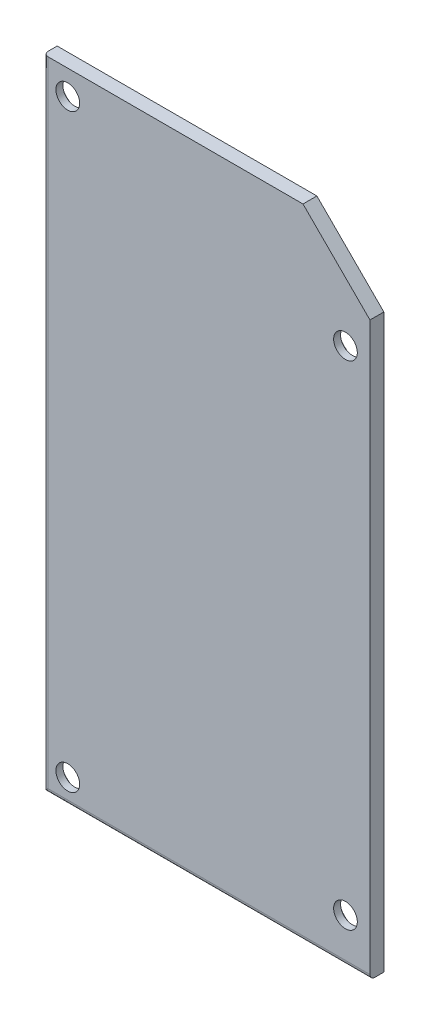
ISO-10303-21;
HEADER;
FILE_DESCRIPTION(('STEP AP214'),'2;1');
FILE_NAME('part.step','',(''),(''),'','','');
FILE_SCHEMA(('AUTOMOTIVE_DESIGN { 1 0 10303 214 1 1 1 1 }'));
ENDSEC;
DATA;
#1=APPLICATION_CONTEXT('core data for automotive mechanical design processes');
#2=APPLICATION_PROTOCOL_DEFINITION('international standard','automotive_design',2000,#1);
#3=PRODUCT_CONTEXT('',#1,'mechanical');
#4=PRODUCT('Part','Part','',(#3));
#5=PRODUCT_RELATED_PRODUCT_CATEGORY('part','',(#4));
#6=PRODUCT_DEFINITION_FORMATION('','',#4);
#7=PRODUCT_DEFINITION_CONTEXT('part definition',#1,'design');
#8=PRODUCT_DEFINITION('design','',#6,#7);
#9=PRODUCT_DEFINITION_SHAPE('','',#8);
#10=(LENGTH_UNIT() NAMED_UNIT(*) SI_UNIT(.MILLI.,.METRE.));
#11=(NAMED_UNIT(*) PLANE_ANGLE_UNIT() SI_UNIT($,.RADIAN.));
#12=(NAMED_UNIT(*) SI_UNIT($,.STERADIAN.) SOLID_ANGLE_UNIT());
#13=UNCERTAINTY_MEASURE_WITH_UNIT(LENGTH_MEASURE(1.E-05),#10,'distance_accuracy_value','');
#14=(GEOMETRIC_REPRESENTATION_CONTEXT(3) GLOBAL_UNCERTAINTY_ASSIGNED_CONTEXT((#13)) GLOBAL_UNIT_ASSIGNED_CONTEXT((#10,
#11,#12)) REPRESENTATION_CONTEXT('',''));
#15=CARTESIAN_POINT('',(0.,0.,0.));
#16=DIRECTION('',(0.,0.,1.));
#17=DIRECTION('',(1.,0.,0.));
#18=AXIS2_PLACEMENT_3D('',#15,#16,#17);
#19=CARTESIAN_POINT('',(0.,0.,28.));
#20=DIRECTION('',(0.,0.,-1.));
#21=DIRECTION('',(-1.,0.,0.));
#22=AXIS2_PLACEMENT_3D('',#19,#20,#21);
#23=PLANE('',#22);
#24=CARTESIAN_POINT('',(3.,3.,28.));
#25=DIRECTION('',(0.,0.,1.));
#26=DIRECTION('',(1.,0.,0.));
#27=AXIS2_PLACEMENT_3D('',#24,#25,#26);
#28=CIRCLE('',#27,2.6);
#29=CARTESIAN_POINT('',(5.6,3.,28.));
#30=VERTEX_POINT('',#29);
#31=EDGE_CURVE('E168',#30,#30,#28,.T.);
#32=ORIENTED_EDGE('',*,*,#31,.T.);
#33=EDGE_LOOP('',(#32));
#34=FACE_BOUND('',#33,.T.);
#35=CARTESIAN_POINT('',(3.,75.2,28.));
#36=DIRECTION('',(0.,0.,1.));
#37=DIRECTION('',(1.,0.,0.));
#38=AXIS2_PLACEMENT_3D('',#35,#36,#37);
#39=CIRCLE('',#38,2.6);
#40=CARTESIAN_POINT('',(5.6,75.2,28.));
#41=VERTEX_POINT('',#40);
#42=EDGE_CURVE('E123',#41,#41,#39,.T.);
#43=ORIENTED_EDGE('',*,*,#42,.T.);
#44=EDGE_LOOP('',(#43));
#45=FACE_BOUND('',#44,.T.);
#46=DIRECTION('',(-1.,0.,0.));
#47=VECTOR('',#46,1.);
#48=CARTESIAN_POINT('',(0.,0.,28.));
#49=LINE('',#48,#47);
#50=CARTESIAN_POINT('',(40.,0.,28.));
#51=VERTEX_POINT('',#50);
#52=CARTESIAN_POINT('',(0.,0.,28.));
#53=VERTEX_POINT('',#52);
#54=EDGE_CURVE('E107',#51,#53,#49,.T.);
#55=ORIENTED_EDGE('',*,*,#54,.T.);
#56=DIRECTION('',(0.,-1.,0.));
#57=VECTOR('',#56,1.);
#58=CARTESIAN_POINT('',(0.,0.,28.));
#59=LINE('',#58,#57);
#60=CARTESIAN_POINT('',(0.,78.2,28.));
#61=VERTEX_POINT('',#60);
#62=EDGE_CURVE('E93',#61,#53,#59,.T.);
#63=ORIENTED_EDGE('',*,*,#62,.F.);
#64=DIRECTION('',(1.,0.,0.));
#65=VECTOR('',#64,1.);
#66=CARTESIAN_POINT('',(0.,78.2,28.));
#67=LINE('',#66,#65);
#68=CARTESIAN_POINT('',(31.8000000000001,78.2,28.));
#69=VERTEX_POINT('',#68);
#70=EDGE_CURVE('E103',#61,#69,#67,.T.);
#71=ORIENTED_EDGE('',*,*,#70,.T.);
#72=DIRECTION('',(0.707106781186544,-0.707106781186551,0.));
#73=VECTOR('',#72,1.);
#74=CARTESIAN_POINT('',(31.8000000000001,78.2,28.));
#75=LINE('',#74,#73);
#76=CARTESIAN_POINT('',(40.,70.,28.));
#77=VERTEX_POINT('',#76);
#78=EDGE_CURVE('E114',#69,#77,#75,.T.);
#79=ORIENTED_EDGE('',*,*,#78,.T.);
#80=DIRECTION('',(0.,-1.,0.));
#81=VECTOR('',#80,1.);
#82=CARTESIAN_POINT('',(40.,0.,28.));
#83=LINE('',#82,#81);
#84=EDGE_CURVE('E117',#77,#51,#83,.T.);
#85=ORIENTED_EDGE('',*,*,#84,.T.);
#86=EDGE_LOOP('',(#55,#63,#71,#79,#85));
#87=FACE_BOUND('',#86,.T.);
#88=CARTESIAN_POINT('',(37.,65.7573593128807,28.));
#89=DIRECTION('',(0.,0.,1.));
#90=DIRECTION('',(1.,0.,0.));
#91=AXIS2_PLACEMENT_3D('',#88,#89,#90);
#92=CIRCLE('',#91,2.6);
#93=CARTESIAN_POINT('',(39.6,65.7573593128807,28.));
#94=VERTEX_POINT('',#93);
#95=EDGE_CURVE('E163',#94,#94,#92,.T.);
#96=ORIENTED_EDGE('',*,*,#95,.T.);
#97=EDGE_LOOP('',(#96));
#98=FACE_BOUND('',#97,.T.);
#99=CARTESIAN_POINT('',(37.,5.39999999999994,28.));
#100=DIRECTION('',(0.,0.,1.));
#101=DIRECTION('',(1.,0.,0.));
#102=AXIS2_PLACEMENT_3D('',#99,#100,#101);
#103=CIRCLE('',#102,2.6);
#104=CARTESIAN_POINT('',(39.6,5.39999999999994,28.));
#105=VERTEX_POINT('',#104);
#106=EDGE_CURVE('E190',#105,#105,#103,.T.);
#107=ORIENTED_EDGE('',*,*,#106,.T.);
#108=EDGE_LOOP('',(#107));
#109=FACE_BOUND('',#108,.T.);
#110=ADVANCED_FACE('F36',(#34,#45,#87,#98,#109),#23,.T.);
#111=CARTESIAN_POINT('',(0.,0.,28.));
#112=DIRECTION('',(0.,1.,0.));
#113=DIRECTION('',(0.,0.,1.));
#114=AXIS2_PLACEMENT_3D('',#111,#112,#113);
#115=PLANE('',#114);
#116=DIRECTION('',(0.,0.,-1.));
#117=VECTOR('',#116,1.);
#118=CARTESIAN_POINT('',(40.,0.,28.));
#119=LINE('',#118,#117);
#120=CARTESIAN_POINT('',(40.,0.,29.1));
#121=VERTEX_POINT('',#120);
#122=EDGE_CURVE('E151',#121,#51,#119,.T.);
#123=ORIENTED_EDGE('',*,*,#122,.F.);
#124=DIRECTION('',(1.,0.,0.));
#125=VECTOR('',#124,1.);
#126=CARTESIAN_POINT('',(0.,0.,29.1));
#127=LINE('',#126,#125);
#128=CARTESIAN_POINT('',(0.,0.,29.1));
#129=VERTEX_POINT('',#128);
#130=EDGE_CURVE('E59',#121,#129,#127,.F.);
#131=ORIENTED_EDGE('',*,*,#130,.T.);
#132=DIRECTION('',(0.,0.,-1.));
#133=VECTOR('',#132,1.);
#134=CARTESIAN_POINT('',(0.,0.,28.));
#135=LINE('',#134,#133);
#136=EDGE_CURVE('E153',#129,#53,#135,.T.);
#137=ORIENTED_EDGE('',*,*,#136,.T.);
#138=ORIENTED_EDGE('',*,*,#54,.F.);
#139=EDGE_LOOP('',(#123,#131,#137,#138));
#140=FACE_BOUND('',#139,.T.);
#141=ADVANCED_FACE('F184',(#140),#115,.F.);
#142=CARTESIAN_POINT('',(40.,0.,28.));
#143=DIRECTION('',(-1.,0.,0.));
#144=DIRECTION('',(0.,0.,1.));
#145=AXIS2_PLACEMENT_3D('',#142,#143,#144);
#146=PLANE('',#145);
#147=DIRECTION('',(0.,1.,0.));
#148=VECTOR('',#147,1.);
#149=CARTESIAN_POINT('',(40.,70.,29.7));
#150=LINE('',#149,#148);
#151=CARTESIAN_POINT('',(40.,0.600000000000003,29.7));
#152=VERTEX_POINT('',#151);
#153=CARTESIAN_POINT('',(40.,70.,29.7));
#154=VERTEX_POINT('',#153);
#155=EDGE_CURVE('E108',#152,#154,#150,.T.);
#156=ORIENTED_EDGE('',*,*,#155,.F.);
#157=CARTESIAN_POINT('',(40.,0.6,29.1));
#158=DIRECTION('',(-1.,0.,0.));
#159=DIRECTION('',(0.,0.,1.));
#160=AXIS2_PLACEMENT_3D('',#157,#158,#159);
#161=CIRCLE('',#160,0.6);
#162=EDGE_CURVE('E174',#152,#121,#161,.F.);
#163=ORIENTED_EDGE('',*,*,#162,.T.);
#164=ORIENTED_EDGE('',*,*,#122,.T.);
#165=ORIENTED_EDGE('',*,*,#84,.F.);
#166=DIRECTION('',(0.,0.,-1.));
#167=VECTOR('',#166,1.);
#168=CARTESIAN_POINT('',(40.,70.,28.));
#169=LINE('',#168,#167);
#170=EDGE_CURVE('E148',#154,#77,#169,.T.);
#171=ORIENTED_EDGE('',*,*,#170,.F.);
#172=EDGE_LOOP('',(#156,#163,#164,#165,#171));
#173=FACE_BOUND('',#172,.T.);
#174=ADVANCED_FACE('F179',(#173),#146,.F.);
#175=CARTESIAN_POINT('',(31.8000000000001,78.2,28.));
#176=DIRECTION('',(-0.707106781186551,-0.707106781186544,0.));
#177=DIRECTION('',(0.707106781186544,-0.707106781186551,0.));
#178=AXIS2_PLACEMENT_3D('',#175,#176,#177);
#179=PLANE('',#178);
#180=ORIENTED_EDGE('',*,*,#78,.F.);
#181=DIRECTION('',(0.,0.,-1.));
#182=VECTOR('',#181,1.);
#183=CARTESIAN_POINT('',(31.8000000000001,78.2,28.));
#184=LINE('',#183,#182);
#185=CARTESIAN_POINT('',(31.8000000000001,78.2,29.7));
#186=VERTEX_POINT('',#185);
#187=EDGE_CURVE('E98',#186,#69,#184,.T.);
#188=ORIENTED_EDGE('',*,*,#187,.F.);
#189=DIRECTION('',(-0.707106781186544,0.707106781186551,0.));
#190=VECTOR('',#189,1.);
#191=CARTESIAN_POINT('',(31.8000000000001,78.2,29.7));
#192=LINE('',#191,#190);
#193=EDGE_CURVE('E140',#154,#186,#192,.T.);
#194=ORIENTED_EDGE('',*,*,#193,.F.);
#195=ORIENTED_EDGE('',*,*,#170,.T.);
#196=EDGE_LOOP('',(#180,#188,#194,#195));
#197=FACE_BOUND('',#196,.T.);
#198=ADVANCED_FACE('F242',(#197),#179,.F.);
#199=CARTESIAN_POINT('',(0.,78.2,28.));
#200=DIRECTION('',(0.,-1.,0.));
#201=DIRECTION('',(0.,0.,-1.));
#202=AXIS2_PLACEMENT_3D('',#199,#200,#201);
#203=PLANE('',#202);
#204=DIRECTION('',(0.,0.,-1.));
#205=VECTOR('',#204,1.);
#206=CARTESIAN_POINT('',(0.,78.2,28.));
#207=LINE('',#206,#205);
#208=CARTESIAN_POINT('',(0.,78.2,29.1));
#209=VERTEX_POINT('',#208);
#210=EDGE_CURVE('E90',#209,#61,#207,.T.);
#211=ORIENTED_EDGE('',*,*,#210,.F.);
#212=CARTESIAN_POINT('',(0.6,78.2,29.1));
#213=DIRECTION('',(0.,-1.,0.));
#214=DIRECTION('',(0.,0.,-1.));
#215=AXIS2_PLACEMENT_3D('',#212,#213,#214);
#216=CIRCLE('',#215,0.6);
#217=CARTESIAN_POINT('',(0.6,78.2,29.7));
#218=VERTEX_POINT('',#217);
#219=EDGE_CURVE('E11',#209,#218,#216,.F.);
#220=ORIENTED_EDGE('',*,*,#219,.T.);
#221=DIRECTION('',(-1.,0.,0.));
#222=VECTOR('',#221,1.);
#223=CARTESIAN_POINT('',(0.,78.2,29.7));
#224=LINE('',#223,#222);
#225=EDGE_CURVE('E99',#186,#218,#224,.T.);
#226=ORIENTED_EDGE('',*,*,#225,.F.);
#227=ORIENTED_EDGE('',*,*,#187,.T.);
#228=ORIENTED_EDGE('',*,*,#70,.F.);
#229=EDGE_LOOP('',(#211,#220,#226,#227,#228));
#230=FACE_BOUND('',#229,.T.);
#231=ADVANCED_FACE('F112',(#230),#203,.F.);
#232=CARTESIAN_POINT('',(0.,78.2,28.));
#233=DIRECTION('',(1.,0.,0.));
#234=DIRECTION('',(0.,0.,-1.));
#235=AXIS2_PLACEMENT_3D('',#232,#233,#234);
#236=PLANE('',#235);
#237=ORIENTED_EDGE('',*,*,#136,.F.);
#238=DIRECTION('',(0.,-1.,0.));
#239=VECTOR('',#238,1.);
#240=CARTESIAN_POINT('',(0.,78.2,29.1));
#241=LINE('',#240,#239);
#242=EDGE_CURVE('E45',#129,#209,#241,.F.);
#243=ORIENTED_EDGE('',*,*,#242,.T.);
#244=ORIENTED_EDGE('',*,*,#210,.T.);
#245=ORIENTED_EDGE('',*,*,#62,.T.);
#246=EDGE_LOOP('',(#237,#243,#244,#245));
#247=FACE_BOUND('',#246,.T.);
#248=ADVANCED_FACE('F92',(#247),#236,.F.);
#249=CARTESIAN_POINT('',(0.,0.,29.7));
#250=DIRECTION('',(0.,0.,-1.));
#251=DIRECTION('',(-1.,0.,0.));
#252=AXIS2_PLACEMENT_3D('',#249,#250,#251);
#253=PLANE('',#252);
#254=CARTESIAN_POINT('',(37.,5.39999999999994,29.7));
#255=DIRECTION('',(0.,0.,1.));
#256=DIRECTION('',(1.,0.,0.));
#257=AXIS2_PLACEMENT_3D('',#254,#255,#256);
#258=CIRCLE('',#257,1.45);
#259=CARTESIAN_POINT('',(38.45,5.39999999999994,29.7));
#260=VERTEX_POINT('',#259);
#261=EDGE_CURVE('E131',#260,#260,#258,.T.);
#262=ORIENTED_EDGE('',*,*,#261,.F.);
#263=EDGE_LOOP('',(#262));
#264=FACE_BOUND('',#263,.T.);
#265=CARTESIAN_POINT('',(3.,75.2,29.7));
#266=DIRECTION('',(0.,0.,1.));
#267=DIRECTION('',(1.,0.,0.));
#268=AXIS2_PLACEMENT_3D('',#265,#266,#267);
#269=CIRCLE('',#268,1.45);
#270=CARTESIAN_POINT('',(4.45,75.2,29.7));
#271=VERTEX_POINT('',#270);
#272=EDGE_CURVE('E109',#271,#271,#269,.T.);
#273=ORIENTED_EDGE('',*,*,#272,.F.);
#274=EDGE_LOOP('',(#273));
#275=FACE_BOUND('',#274,.T.);
#276=DIRECTION('',(0.,-1.,0.));
#277=VECTOR('',#276,1.);
#278=CARTESIAN_POINT('',(0.6,0.,29.7));
#279=LINE('',#278,#277);
#280=CARTESIAN_POINT('',(0.6,0.6,29.7));
#281=VERTEX_POINT('',#280);
#282=EDGE_CURVE('E154',#218,#281,#279,.T.);
#283=ORIENTED_EDGE('',*,*,#282,.T.);
#284=DIRECTION('',(1.,0.,0.));
#285=VECTOR('',#284,1.);
#286=CARTESIAN_POINT('',(0.,0.6,29.7));
#287=LINE('',#286,#285);
#288=EDGE_CURVE('E171',#281,#152,#287,.T.);
#289=ORIENTED_EDGE('',*,*,#288,.T.);
#290=ORIENTED_EDGE('',*,*,#155,.T.);
#291=ORIENTED_EDGE('',*,*,#193,.T.);
#292=ORIENTED_EDGE('',*,*,#225,.T.);
#293=EDGE_LOOP('',(#283,#289,#290,#291,#292));
#294=FACE_BOUND('',#293,.T.);
#295=CARTESIAN_POINT('',(37.,65.7573593128807,29.7));
#296=DIRECTION('',(0.,0.,1.));
#297=DIRECTION('',(1.,0.,0.));
#298=AXIS2_PLACEMENT_3D('',#295,#296,#297);
#299=CIRCLE('',#298,1.45);
#300=CARTESIAN_POINT('',(38.45,65.7573593128807,29.7));
#301=VERTEX_POINT('',#300);
#302=EDGE_CURVE('E134',#301,#301,#299,.T.);
#303=ORIENTED_EDGE('',*,*,#302,.F.);
#304=EDGE_LOOP('',(#303));
#305=FACE_BOUND('',#304,.T.);
#306=CARTESIAN_POINT('',(3.,3.,29.7));
#307=DIRECTION('',(0.,0.,1.));
#308=DIRECTION('',(1.,0.,0.));
#309=AXIS2_PLACEMENT_3D('',#306,#307,#308);
#310=CIRCLE('',#309,1.45);
#311=CARTESIAN_POINT('',(4.45,3.,29.7));
#312=VERTEX_POINT('',#311);
#313=EDGE_CURVE('E128',#312,#312,#310,.T.);
#314=ORIENTED_EDGE('',*,*,#313,.F.);
#315=EDGE_LOOP('',(#314));
#316=FACE_BOUND('',#315,.T.);
#317=ADVANCED_FACE('F236',(#264,#275,#294,#305,#316),#253,.F.);
#318=CARTESIAN_POINT('',(3.,75.2,29.7));
#319=DIRECTION('',(0.,0.,-1.));
#320=DIRECTION('',(-1.,0.,0.));
#321=AXIS2_PLACEMENT_3D('',#318,#319,#320);
#322=CYLINDRICAL_SURFACE('',#321,1.45);
#323=CARTESIAN_POINT('',(3.,75.2,28.85));
#324=DIRECTION('',(0.,0.,1.));
#325=DIRECTION('',(1.,0.,0.));
#326=AXIS2_PLACEMENT_3D('',#323,#324,#325);
#327=CIRCLE('',#326,1.45);
#328=CARTESIAN_POINT('',(4.45,75.2,28.85));
#329=VERTEX_POINT('',#328);
#330=EDGE_CURVE('E115',#329,#329,#327,.T.);
#331=ORIENTED_EDGE('',*,*,#330,.F.);
#332=EDGE_LOOP('',(#331));
#333=FACE_BOUND('',#332,.T.);
#334=ORIENTED_EDGE('',*,*,#272,.T.);
#335=EDGE_LOOP('',(#334));
#336=FACE_BOUND('',#335,.T.);
#337=ADVANCED_FACE('F262',(#333,#336),#322,.F.);
#338=CARTESIAN_POINT('',(37.,65.7573593128807,29.7));
#339=DIRECTION('',(0.,0.,-1.));
#340=DIRECTION('',(-1.,0.,0.));
#341=AXIS2_PLACEMENT_3D('',#338,#339,#340);
#342=CYLINDRICAL_SURFACE('',#341,1.45);
#343=CARTESIAN_POINT('',(37.,65.7573593128807,28.85));
#344=DIRECTION('',(0.,0.,1.));
#345=DIRECTION('',(1.,0.,0.));
#346=AXIS2_PLACEMENT_3D('',#343,#344,#345);
#347=CIRCLE('',#346,1.45);
#348=CARTESIAN_POINT('',(38.45,65.7573593128807,28.85));
#349=VERTEX_POINT('',#348);
#350=EDGE_CURVE('E156',#349,#349,#347,.T.);
#351=ORIENTED_EDGE('',*,*,#350,.F.);
#352=EDGE_LOOP('',(#351));
#353=FACE_BOUND('',#352,.T.);
#354=ORIENTED_EDGE('',*,*,#302,.T.);
#355=EDGE_LOOP('',(#354));
#356=FACE_BOUND('',#355,.T.);
#357=ADVANCED_FACE('F269',(#353,#356),#342,.F.);
#358=CARTESIAN_POINT('',(37.,5.39999999999994,29.7));
#359=DIRECTION('',(0.,0.,-1.));
#360=DIRECTION('',(-1.,0.,0.));
#361=AXIS2_PLACEMENT_3D('',#358,#359,#360);
#362=CYLINDRICAL_SURFACE('',#361,1.45);
#363=CARTESIAN_POINT('',(37.,5.39999999999994,28.85));
#364=DIRECTION('',(0.,0.,1.));
#365=DIRECTION('',(1.,0.,0.));
#366=AXIS2_PLACEMENT_3D('',#363,#364,#365);
#367=CIRCLE('',#366,1.45);
#368=CARTESIAN_POINT('',(38.45,5.39999999999994,28.85));
#369=VERTEX_POINT('',#368);
#370=EDGE_CURVE('E165',#369,#369,#367,.T.);
#371=ORIENTED_EDGE('',*,*,#370,.F.);
#372=EDGE_LOOP('',(#371));
#373=FACE_BOUND('',#372,.T.);
#374=ORIENTED_EDGE('',*,*,#261,.T.);
#375=EDGE_LOOP('',(#374));
#376=FACE_BOUND('',#375,.T.);
#377=ADVANCED_FACE('F224',(#373,#376),#362,.F.);
#378=CARTESIAN_POINT('',(3.,3.,29.7));
#379=DIRECTION('',(0.,0.,-1.));
#380=DIRECTION('',(-1.,0.,0.));
#381=AXIS2_PLACEMENT_3D('',#378,#379,#380);
#382=CYLINDRICAL_SURFACE('',#381,1.45);
#383=CARTESIAN_POINT('',(3.,3.,28.85));
#384=DIRECTION('',(0.,0.,1.));
#385=DIRECTION('',(1.,0.,0.));
#386=AXIS2_PLACEMENT_3D('',#383,#384,#385);
#387=CIRCLE('',#386,1.45);
#388=CARTESIAN_POINT('',(4.45,3.,28.85));
#389=VERTEX_POINT('',#388);
#390=EDGE_CURVE('E160',#389,#389,#387,.T.);
#391=ORIENTED_EDGE('',*,*,#390,.F.);
#392=EDGE_LOOP('',(#391));
#393=FACE_BOUND('',#392,.T.);
#394=ORIENTED_EDGE('',*,*,#313,.T.);
#395=EDGE_LOOP('',(#394));
#396=FACE_BOUND('',#395,.T.);
#397=ADVANCED_FACE('F215',(#393,#396),#382,.F.);
#398=CARTESIAN_POINT('',(3.,75.2,28.85));
#399=DIRECTION('',(0.,0.,-1.));
#400=DIRECTION('',(-1.,0.,0.));
#401=AXIS2_PLACEMENT_3D('',#398,#399,#400);
#402=CYLINDRICAL_SURFACE('',#401,2.6);
#403=CARTESIAN_POINT('',(3.,75.2,28.85));
#404=DIRECTION('',(0.,0.,1.));
#405=DIRECTION('',(1.,0.,0.));
#406=AXIS2_PLACEMENT_3D('',#403,#404,#405);
#407=CIRCLE('',#406,2.6);
#408=CARTESIAN_POINT('',(5.6,75.2,28.85));
#409=VERTEX_POINT('',#408);
#410=EDGE_CURVE('E120',#409,#409,#407,.T.);
#411=ORIENTED_EDGE('',*,*,#410,.T.);
#412=EDGE_LOOP('',(#411));
#413=FACE_BOUND('',#412,.T.);
#414=ORIENTED_EDGE('',*,*,#42,.F.);
#415=EDGE_LOOP('',(#414));
#416=FACE_BOUND('',#415,.T.);
#417=ADVANCED_FACE('F212',(#413,#416),#402,.F.);
#418=CARTESIAN_POINT('',(3.,75.2,28.85));
#419=DIRECTION('',(0.,0.,1.));
#420=DIRECTION('',(1.,0.,0.));
#421=AXIS2_PLACEMENT_3D('',#418,#419,#420);
#422=PLANE('',#421);
#423=ORIENTED_EDGE('',*,*,#330,.T.);
#424=EDGE_LOOP('',(#423));
#425=FACE_BOUND('',#424,.T.);
#426=ORIENTED_EDGE('',*,*,#410,.F.);
#427=EDGE_LOOP('',(#426));
#428=FACE_BOUND('',#427,.T.);
#429=ADVANCED_FACE('F214',(#425,#428),#422,.F.);
#430=CARTESIAN_POINT('',(37.,65.7573593128807,28.85));
#431=DIRECTION('',(0.,0.,-1.));
#432=DIRECTION('',(-1.,0.,0.));
#433=AXIS2_PLACEMENT_3D('',#430,#431,#432);
#434=CYLINDRICAL_SURFACE('',#433,2.6);
#435=CARTESIAN_POINT('',(37.,65.7573593128807,28.85));
#436=DIRECTION('',(0.,0.,1.));
#437=DIRECTION('',(1.,0.,0.));
#438=AXIS2_PLACEMENT_3D('',#435,#436,#437);
#439=CIRCLE('',#438,2.6);
#440=CARTESIAN_POINT('',(39.6,65.7573593128807,28.85));
#441=VERTEX_POINT('',#440);
#442=EDGE_CURVE('E159',#441,#441,#439,.T.);
#443=ORIENTED_EDGE('',*,*,#442,.T.);
#444=EDGE_LOOP('',(#443));
#445=FACE_BOUND('',#444,.T.);
#446=ORIENTED_EDGE('',*,*,#95,.F.);
#447=EDGE_LOOP('',(#446));
#448=FACE_BOUND('',#447,.T.);
#449=ADVANCED_FACE('F221',(#445,#448),#434,.F.);
#450=CARTESIAN_POINT('',(37.,65.7573593128807,28.85));
#451=DIRECTION('',(0.,0.,1.));
#452=DIRECTION('',(1.,0.,0.));
#453=AXIS2_PLACEMENT_3D('',#450,#451,#452);
#454=PLANE('',#453);
#455=ORIENTED_EDGE('',*,*,#350,.T.);
#456=EDGE_LOOP('',(#455));
#457=FACE_BOUND('',#456,.T.);
#458=ORIENTED_EDGE('',*,*,#442,.F.);
#459=EDGE_LOOP('',(#458));
#460=FACE_BOUND('',#459,.T.);
#461=ADVANCED_FACE('F282',(#457,#460),#454,.F.);
#462=CARTESIAN_POINT('',(3.,3.,28.85));
#463=DIRECTION('',(0.,0.,-1.));
#464=DIRECTION('',(-1.,0.,0.));
#465=AXIS2_PLACEMENT_3D('',#462,#463,#464);
#466=CYLINDRICAL_SURFACE('',#465,2.6);
#467=CARTESIAN_POINT('',(3.,3.,28.85));
#468=DIRECTION('',(0.,0.,1.));
#469=DIRECTION('',(1.,0.,0.));
#470=AXIS2_PLACEMENT_3D('',#467,#468,#469);
#471=CIRCLE('',#470,2.6);
#472=CARTESIAN_POINT('',(5.6,3.,28.85));
#473=VERTEX_POINT('',#472);
#474=EDGE_CURVE('E164',#473,#473,#471,.T.);
#475=ORIENTED_EDGE('',*,*,#474,.T.);
#476=EDGE_LOOP('',(#475));
#477=FACE_BOUND('',#476,.T.);
#478=ORIENTED_EDGE('',*,*,#31,.F.);
#479=EDGE_LOOP('',(#478));
#480=FACE_BOUND('',#479,.T.);
#481=ADVANCED_FACE('F285',(#477,#480),#466,.F.);
#482=CARTESIAN_POINT('',(3.,3.,28.85));
#483=DIRECTION('',(0.,0.,1.));
#484=DIRECTION('',(1.,0.,0.));
#485=AXIS2_PLACEMENT_3D('',#482,#483,#484);
#486=PLANE('',#485);
#487=ORIENTED_EDGE('',*,*,#390,.T.);
#488=EDGE_LOOP('',(#487));
#489=FACE_BOUND('',#488,.T.);
#490=ORIENTED_EDGE('',*,*,#474,.F.);
#491=EDGE_LOOP('',(#490));
#492=FACE_BOUND('',#491,.T.);
#493=ADVANCED_FACE('F298',(#489,#492),#486,.F.);
#494=CARTESIAN_POINT('',(37.,5.39999999999994,28.85));
#495=DIRECTION('',(0.,0.,-1.));
#496=DIRECTION('',(-1.,0.,0.));
#497=AXIS2_PLACEMENT_3D('',#494,#495,#496);
#498=CYLINDRICAL_SURFACE('',#497,2.6);
#499=CARTESIAN_POINT('',(37.,5.39999999999994,28.85));
#500=DIRECTION('',(0.,0.,1.));
#501=DIRECTION('',(1.,0.,0.));
#502=AXIS2_PLACEMENT_3D('',#499,#500,#501);
#503=CIRCLE('',#502,2.6);
#504=CARTESIAN_POINT('',(39.6,5.39999999999994,28.85));
#505=VERTEX_POINT('',#504);
#506=EDGE_CURVE('E169',#505,#505,#503,.T.);
#507=ORIENTED_EDGE('',*,*,#506,.T.);
#508=EDGE_LOOP('',(#507));
#509=FACE_BOUND('',#508,.T.);
#510=ORIENTED_EDGE('',*,*,#106,.F.);
#511=EDGE_LOOP('',(#510));
#512=FACE_BOUND('',#511,.T.);
#513=ADVANCED_FACE('F255',(#509,#512),#498,.F.);
#514=CARTESIAN_POINT('',(37.,5.39999999999994,28.85));
#515=DIRECTION('',(0.,0.,1.));
#516=DIRECTION('',(1.,0.,0.));
#517=AXIS2_PLACEMENT_3D('',#514,#515,#516);
#518=PLANE('',#517);
#519=ORIENTED_EDGE('',*,*,#370,.T.);
#520=EDGE_LOOP('',(#519));
#521=FACE_BOUND('',#520,.T.);
#522=ORIENTED_EDGE('',*,*,#506,.F.);
#523=EDGE_LOOP('',(#522));
#524=FACE_BOUND('',#523,.T.);
#525=ADVANCED_FACE('F251',(#521,#524),#518,.F.);
#526=CARTESIAN_POINT('',(0.6,0.,29.1));
#527=DIRECTION('',(0.,-1.,0.));
#528=DIRECTION('',(0.,0.,-1.));
#529=AXIS2_PLACEMENT_3D('',#526,#527,#528);
#530=CYLINDRICAL_SURFACE('',#529,0.6);
#531=ORIENTED_EDGE('',*,*,#219,.F.);
#532=ORIENTED_EDGE('',*,*,#242,.F.);
#533=CARTESIAN_POINT('',(0.6,0.6,29.1));
#534=DIRECTION('',(0.707106781186547,-0.707106781186547,0.));
#535=DIRECTION('',(-0.707106781186547,-0.707106781186547,0.));
#536=AXIS2_PLACEMENT_3D('',#533,#534,#535);
#537=ELLIPSE('',#536,0.848528137423857,0.6);
#538=EDGE_CURVE('E40',#281,#129,#537,.T.);
#539=ORIENTED_EDGE('',*,*,#538,.F.);
#540=ORIENTED_EDGE('',*,*,#282,.F.);
#541=EDGE_LOOP('',(#531,#532,#539,#540));
#542=FACE_BOUND('',#541,.T.);
#543=ADVANCED_FACE('F38',(#542),#530,.T.);
#544=CARTESIAN_POINT('',(0.,0.6,29.1));
#545=DIRECTION('',(1.,0.,0.));
#546=DIRECTION('',(0.,0.,-1.));
#547=AXIS2_PLACEMENT_3D('',#544,#545,#546);
#548=CYLINDRICAL_SURFACE('',#547,0.6);
#549=ORIENTED_EDGE('',*,*,#538,.T.);
#550=ORIENTED_EDGE('',*,*,#130,.F.);
#551=ORIENTED_EDGE('',*,*,#162,.F.);
#552=ORIENTED_EDGE('',*,*,#288,.F.);
#553=EDGE_LOOP('',(#549,#550,#551,#552));
#554=FACE_BOUND('',#553,.T.);
#555=ADVANCED_FACE('F186',(#554),#548,.T.);
#556=CLOSED_SHELL('',(#110,#141,#174,#198,#231,#248,#317,#337,#357,#377,#397,#417,#429,#449,
#461,#481,#493,#513,#525,#543,#555));
#557=MANIFOLD_SOLID_BREP('B2',#556);
#558=ADVANCED_BREP_SHAPE_REPRESENTATION('',(#18,#557),#14);
#559=SHAPE_DEFINITION_REPRESENTATION(#9,#558);
ENDSEC;
END-ISO-10303-21;
